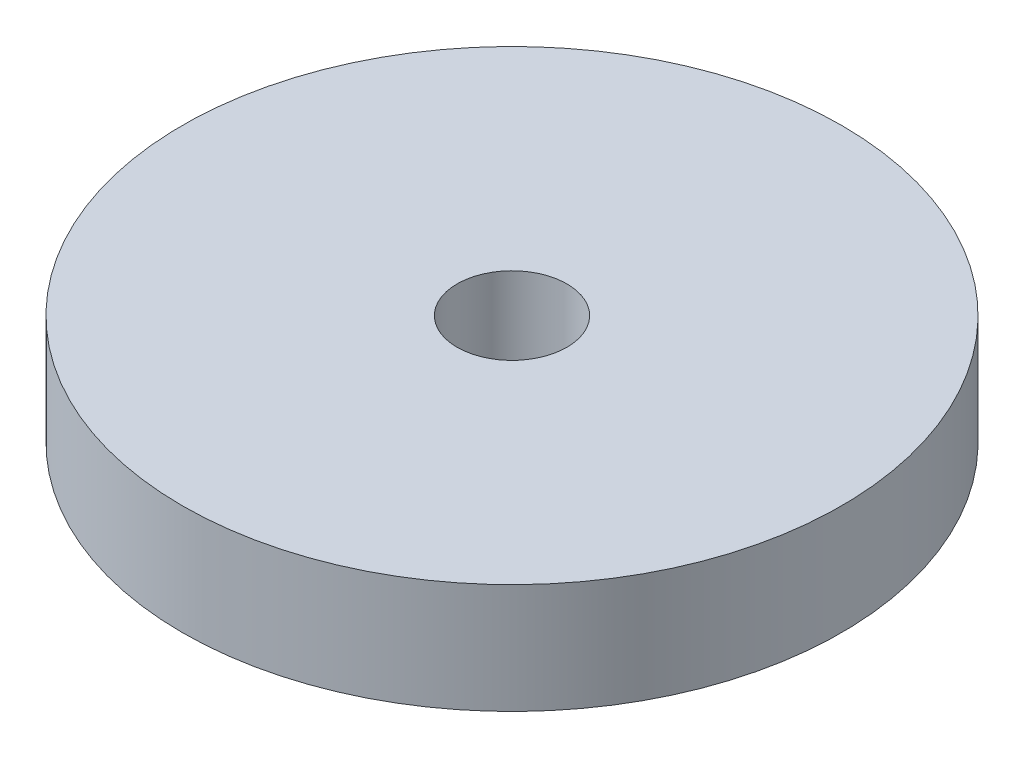
ISO-10303-21;
HEADER;
FILE_DESCRIPTION(('STEP AP214'),'2;1');
FILE_NAME('part.step','',(''),(''),'','','');
FILE_SCHEMA(('AUTOMOTIVE_DESIGN { 1 0 10303 214 1 1 1 1 }'));
ENDSEC;
DATA;
#1=APPLICATION_CONTEXT('core data for automotive mechanical design processes');
#2=APPLICATION_PROTOCOL_DEFINITION('international standard','automotive_design',2000,#1);
#3=PRODUCT_CONTEXT('',#1,'mechanical');
#4=PRODUCT('Part','Part','',(#3));
#5=PRODUCT_RELATED_PRODUCT_CATEGORY('part','',(#4));
#6=PRODUCT_DEFINITION_FORMATION('','',#4);
#7=PRODUCT_DEFINITION_CONTEXT('part definition',#1,'design');
#8=PRODUCT_DEFINITION('design','',#6,#7);
#9=PRODUCT_DEFINITION_SHAPE('','',#8);
#10=(LENGTH_UNIT() NAMED_UNIT(*) SI_UNIT(.MILLI.,.METRE.));
#11=(NAMED_UNIT(*) PLANE_ANGLE_UNIT() SI_UNIT($,.RADIAN.));
#12=(NAMED_UNIT(*) SI_UNIT($,.STERADIAN.) SOLID_ANGLE_UNIT());
#13=UNCERTAINTY_MEASURE_WITH_UNIT(LENGTH_MEASURE(1.E-05),#10,'distance_accuracy_value','');
#14=(GEOMETRIC_REPRESENTATION_CONTEXT(3) GLOBAL_UNCERTAINTY_ASSIGNED_CONTEXT((#13)) GLOBAL_UNIT_ASSIGNED_CONTEXT((#10,
#11,#12)) REPRESENTATION_CONTEXT('',''));
#15=CARTESIAN_POINT('',(0.,0.,0.));
#16=DIRECTION('',(0.,0.,1.));
#17=DIRECTION('',(1.,0.,0.));
#18=AXIS2_PLACEMENT_3D('',#15,#16,#17);
#19=CARTESIAN_POINT('',(0.,3.175,0.));
#20=DIRECTION('',(0.,1.,0.));
#21=DIRECTION('',(0.,0.,1.));
#22=AXIS2_PLACEMENT_3D('',#19,#20,#21);
#23=PLANE('',#22);
#24=CARTESIAN_POINT('',(0.,3.175,0.));
#25=DIRECTION('',(0.,1.,0.));
#26=DIRECTION('',(0.,0.,1.));
#27=AXIS2_PLACEMENT_3D('',#24,#25,#26);
#28=CIRCLE('',#27,9.525);
#29=CARTESIAN_POINT('',(0.,3.175,9.525));
#30=VERTEX_POINT('',#29);
#31=EDGE_CURVE('E12',#30,#30,#28,.T.);
#32=ORIENTED_EDGE('',*,*,#31,.T.);
#33=EDGE_LOOP('',(#32));
#34=FACE_BOUND('',#33,.T.);
#35=CARTESIAN_POINT('',(0.,3.175,0.));
#36=DIRECTION('',(0.,1.,0.));
#37=DIRECTION('',(0.,0.,1.));
#38=AXIS2_PLACEMENT_3D('',#35,#36,#37);
#39=CIRCLE('',#38,1.5875);
#40=CARTESIAN_POINT('',(0.,3.175,1.5875));
#41=VERTEX_POINT('',#40);
#42=EDGE_CURVE('E55',#41,#41,#39,.T.);
#43=ORIENTED_EDGE('',*,*,#42,.F.);
#44=EDGE_LOOP('',(#43));
#45=FACE_BOUND('',#44,.T.);
#46=ADVANCED_FACE('F44',(#34,#45),#23,.T.);
#47=CARTESIAN_POINT('',(0.,0.,0.));
#48=DIRECTION('',(0.,1.,0.));
#49=DIRECTION('',(0.,0.,1.));
#50=AXIS2_PLACEMENT_3D('',#47,#48,#49);
#51=PLANE('',#50);
#52=CARTESIAN_POINT('',(0.,0.,0.));
#53=DIRECTION('',(0.,1.,0.));
#54=DIRECTION('',(0.,0.,1.));
#55=AXIS2_PLACEMENT_3D('',#52,#53,#54);
#56=CIRCLE('',#55,9.525);
#57=CARTESIAN_POINT('',(0.,0.,9.525));
#58=VERTEX_POINT('',#57);
#59=EDGE_CURVE('E48',#58,#58,#56,.T.);
#60=ORIENTED_EDGE('',*,*,#59,.F.);
#61=EDGE_LOOP('',(#60));
#62=FACE_BOUND('',#61,.T.);
#63=CARTESIAN_POINT('',(0.,0.,0.));
#64=DIRECTION('',(0.,1.,0.));
#65=DIRECTION('',(0.,0.,1.));
#66=AXIS2_PLACEMENT_3D('',#63,#64,#65);
#67=CIRCLE('',#66,1.5875);
#68=CARTESIAN_POINT('',(0.,0.,1.5875));
#69=VERTEX_POINT('',#68);
#70=EDGE_CURVE('E57',#69,#69,#67,.T.);
#71=ORIENTED_EDGE('',*,*,#70,.T.);
#72=EDGE_LOOP('',(#71));
#73=FACE_BOUND('',#72,.T.);
#74=ADVANCED_FACE('F67',(#62,#73),#51,.F.);
#75=CARTESIAN_POINT('',(0.,3.175,0.));
#76=DIRECTION('',(0.,-1.,0.));
#77=DIRECTION('',(0.,0.,-1.));
#78=AXIS2_PLACEMENT_3D('',#75,#76,#77);
#79=CYLINDRICAL_SURFACE('',#78,9.525);
#80=ORIENTED_EDGE('',*,*,#31,.F.);
#81=EDGE_LOOP('',(#80));
#82=FACE_BOUND('',#81,.T.);
#83=ORIENTED_EDGE('',*,*,#59,.T.);
#84=EDGE_LOOP('',(#83));
#85=FACE_BOUND('',#84,.T.);
#86=ADVANCED_FACE('F46',(#82,#85),#79,.T.);
#87=CARTESIAN_POINT('',(0.,3.175,0.));
#88=DIRECTION('',(0.,-1.,0.));
#89=DIRECTION('',(0.,0.,-1.));
#90=AXIS2_PLACEMENT_3D('',#87,#88,#89);
#91=CYLINDRICAL_SURFACE('',#90,1.5875);
#92=ORIENTED_EDGE('',*,*,#42,.T.);
#93=EDGE_LOOP('',(#92));
#94=FACE_BOUND('',#93,.T.);
#95=ORIENTED_EDGE('',*,*,#70,.F.);
#96=EDGE_LOOP('',(#95));
#97=FACE_BOUND('',#96,.T.);
#98=ADVANCED_FACE('F63',(#94,#97),#91,.F.);
#99=CLOSED_SHELL('',(#46,#74,#86,#98));
#100=MANIFOLD_SOLID_BREP('B2',#99);
#101=ADVANCED_BREP_SHAPE_REPRESENTATION('',(#18,#100),#14);
#102=SHAPE_DEFINITION_REPRESENTATION(#9,#101);
ENDSEC;
END-ISO-10303-21;
